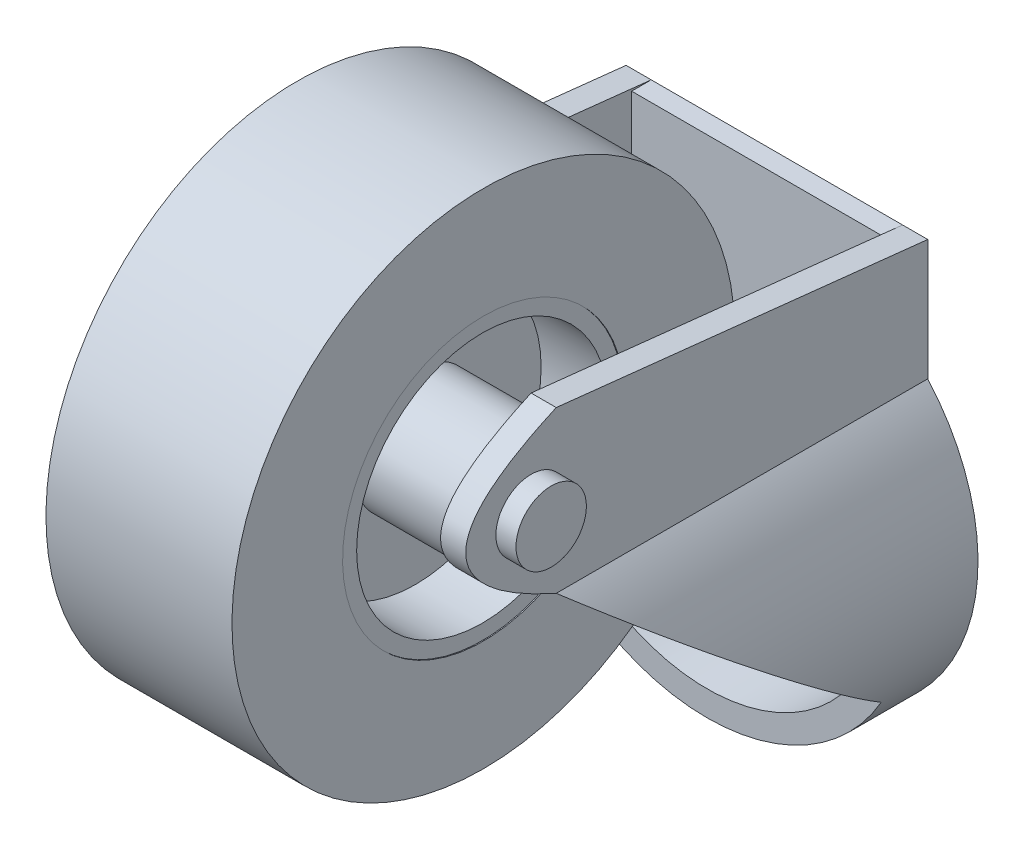
ISO-10303-21;
HEADER;
FILE_DESCRIPTION(('STEP AP214'),'2;1');
FILE_NAME('part.step','',(''),(''),'','','');
FILE_SCHEMA(('AUTOMOTIVE_DESIGN { 1 0 10303 214 1 1 1 1 }'));
ENDSEC;
DATA;
#1=APPLICATION_CONTEXT('core data for automotive mechanical design processes');
#2=APPLICATION_PROTOCOL_DEFINITION('international standard','automotive_design',2000,#1);
#3=PRODUCT_CONTEXT('',#1,'mechanical');
#4=PRODUCT('Part','Part','',(#3));
#5=PRODUCT_RELATED_PRODUCT_CATEGORY('part','',(#4));
#6=PRODUCT_DEFINITION_FORMATION('','',#4);
#7=PRODUCT_DEFINITION_CONTEXT('part definition',#1,'design');
#8=PRODUCT_DEFINITION('design','',#6,#7);
#9=PRODUCT_DEFINITION_SHAPE('','',#8);
#10=(LENGTH_UNIT() NAMED_UNIT(*) SI_UNIT(.MILLI.,.METRE.));
#11=(NAMED_UNIT(*) PLANE_ANGLE_UNIT() SI_UNIT($,.RADIAN.));
#12=(NAMED_UNIT(*) SI_UNIT($,.STERADIAN.) SOLID_ANGLE_UNIT());
#13=UNCERTAINTY_MEASURE_WITH_UNIT(LENGTH_MEASURE(1.E-05),#10,'distance_accuracy_value','');
#14=(GEOMETRIC_REPRESENTATION_CONTEXT(3) GLOBAL_UNCERTAINTY_ASSIGNED_CONTEXT((#13)) GLOBAL_UNIT_ASSIGNED_CONTEXT((#10,
#11,#12)) REPRESENTATION_CONTEXT('',''));
#15=CARTESIAN_POINT('',(0.,0.,0.));
#16=DIRECTION('',(0.,0.,1.));
#17=DIRECTION('',(1.,0.,0.));
#18=AXIS2_PLACEMENT_3D('',#15,#16,#17);
#19=CARTESIAN_POINT('',(-8.99996347011657,21.2287151304649,38.7000000000901));
#20=DIRECTION('',(1.,0.,0.));
#21=DIRECTION('',(0.,1.,0.));
#22=AXIS2_PLACEMENT_3D('',#19,#20,#21);
#23=CYLINDRICAL_SURFACE('',#22,12.5);
#24=CARTESIAN_POINT('',(2.75003652988343,21.2287151304649,38.7000000000901));
#25=DIRECTION('',(-1.,0.,0.));
#26=DIRECTION('',(0.,-1.,0.));
#27=AXIS2_PLACEMENT_3D('',#24,#25,#26);
#28=CIRCLE('',#27,12.5);
#29=CARTESIAN_POINT('',(2.75003652988342,8.72871513046489,38.7000000000901));
#30=VERTEX_POINT('',#29);
#31=EDGE_CURVE('E272',#30,#30,#28,.T.);
#32=ORIENTED_EDGE('',*,*,#31,.T.);
#33=EDGE_LOOP('',(#32));
#34=FACE_BOUND('',#33,.T.);
#35=CARTESIAN_POINT('',(9.40003652988343,21.2287151304649,38.7000000000901));
#36=DIRECTION('',(1.,0.,0.));
#37=DIRECTION('',(0.,1.,0.));
#38=AXIS2_PLACEMENT_3D('',#35,#36,#37);
#39=CIRCLE('',#38,12.5);
#40=CARTESIAN_POINT('',(9.40003652988343,33.7287151304649,38.7000000000901));
#41=VERTEX_POINT('',#40);
#42=EDGE_CURVE('E492',#41,#41,#39,.T.);
#43=ORIENTED_EDGE('',*,*,#42,.T.);
#44=EDGE_LOOP('',(#43));
#45=FACE_BOUND('',#44,.T.);
#46=ADVANCED_FACE('F50',(#34,#45),#23,.F.);
#47=CARTESIAN_POINT('',(-2.24996347011657,21.2287151304649,38.7000000000901));
#48=DIRECTION('',(-1.,0.,0.));
#49=DIRECTION('',(0.,-1.,0.));
#50=AXIS2_PLACEMENT_3D('',#47,#48,#49);
#51=CIRCLE('',#50,12.5);
#52=CARTESIAN_POINT('',(-2.24996347011658,8.7287151304649,38.7000000000901));
#53=VERTEX_POINT('',#52);
#54=EDGE_CURVE('E274',#53,#53,#51,.F.);
#55=ORIENTED_EDGE('',*,*,#54,.T.);
#56=EDGE_LOOP('',(#55));
#57=FACE_BOUND('',#56,.T.);
#58=CARTESIAN_POINT('',(-8.89996347011657,21.2287151304649,38.7000000000899));
#59=DIRECTION('',(-1.,0.,0.));
#60=DIRECTION('',(0.,-1.,0.));
#61=AXIS2_PLACEMENT_3D('',#58,#59,#60);
#62=CIRCLE('',#61,12.5000000000002);
#63=CARTESIAN_POINT('',(-8.89996347011658,8.72871513046471,38.7000000000899));
#64=VERTEX_POINT('',#63);
#65=EDGE_CURVE('E484',#64,#64,#62,.T.);
#66=ORIENTED_EDGE('',*,*,#65,.T.);
#67=EDGE_LOOP('',(#66));
#68=FACE_BOUND('',#67,.T.);
#69=ADVANCED_FACE('F239',(#57,#68),#23,.F.);
#70=CARTESIAN_POINT('',(-12.5000365298834,25.2287151342132,6.95));
#71=DIRECTION('',(-1.,0.,0.));
#72=DIRECTION('',(0.,-1.,0.));
#73=AXIS2_PLACEMENT_3D('',#70,#71,#72);
#74=PLANE('',#73);
#75=DIRECTION('',(0.,0.612221207535144,0.79068653273229));
#76=VECTOR('',#75,1.);
#77=CARTESIAN_POINT('',(-12.5000365298834,3.20424090214857,24.0033449748874));
#78=LINE('',#77,#76);
#79=CARTESIAN_POINT('',(-12.5000365298834,12.2474114306485,35.682641709599));
#80=VERTEX_POINT('',#79);
#81=CARTESIAN_POINT('',(-12.5000365298834,13.2287151342133,36.95));
#82=VERTEX_POINT('',#81);
#83=EDGE_CURVE('E287',#80,#82,#78,.T.);
#84=ORIENTED_EDGE('',*,*,#83,.F.);
#85=DIRECTION('',(0.,0.,-1.));
#86=VECTOR('',#85,1.);
#87=CARTESIAN_POINT('',(-12.5000365298834,12.2474114306485,6.95));
#88=LINE('',#87,#86);
#89=CARTESIAN_POINT('',(-12.5000365298834,12.2474114306485,1.95));
#90=VERTEX_POINT('',#89);
#91=EDGE_CURVE('E73',#80,#90,#88,.T.);
#92=ORIENTED_EDGE('',*,*,#91,.T.);
#93=DIRECTION('',(0.,1.,0.));
#94=VECTOR('',#93,1.);
#95=CARTESIAN_POINT('',(-12.5000365298834,25.2287151342132,1.95));
#96=LINE('',#95,#94);
#97=CARTESIAN_POINT('',(-12.5000365298834,25.2287151342132,1.95));
#98=VERTEX_POINT('',#97);
#99=EDGE_CURVE('E170',#90,#98,#96,.T.);
#100=ORIENTED_EDGE('',*,*,#99,.T.);
#101=DIRECTION('',(0.,0.,1.));
#102=VECTOR('',#101,1.);
#103=CARTESIAN_POINT('',(-12.5000365298834,25.2287151342132,0.));
#104=LINE('',#103,#102);
#105=CARTESIAN_POINT('',(-12.5000365298834,25.2287151342132,0.));
#106=VERTEX_POINT('',#105);
#107=EDGE_CURVE('E355',#106,#98,#104,.T.);
#108=ORIENTED_EDGE('',*,*,#107,.F.);
#109=DIRECTION('',(0.,-0.107625601573369,-0.994191495581193));
#110=VECTOR('',#109,1.);
#111=CARTESIAN_POINT('',(-12.5000365298834,29.22871513,36.95));
#112=LINE('',#111,#110);
#113=CARTESIAN_POINT('',(-12.5000365298834,29.22871513,36.95));
#114=VERTEX_POINT('',#113);
#115=EDGE_CURVE('E367',#114,#106,#112,.T.);
#116=ORIENTED_EDGE('',*,*,#115,.F.);
#117=CARTESIAN_POINT('',(-12.5000365298834,13.2287151342133,36.95));
#118=CARTESIAN_POINT('',(-12.5000365298834,21.228715129753,54.95));
#119=CARTESIAN_POINT('',(-12.5000365298834,29.22871513,36.95));
#120=B_SPLINE_CURVE_WITH_KNOTS('',2,(#117,#118,#119),.UNSPECIFIED.,.F.,.F.,(3,3),(0.,1.),.UNSPECIFIED.);
#121=EDGE_CURVE('E401',#114,#82,#120,.F.);
#122=ORIENTED_EDGE('',*,*,#121,.T.);
#123=EDGE_LOOP('',(#84,#92,#100,#108,#116,#122));
#124=FACE_BOUND('',#123,.T.);
#125=CARTESIAN_POINT('',(-12.5000365299002,21.2287151304525,38.7000000000048));
#126=DIRECTION('',(-1.,0.,0.));
#127=DIRECTION('',(0.,-1.,0.));
#128=AXIS2_PLACEMENT_3D('',#125,#126,#127);
#129=CIRCLE('',#128,5.99999999999999);
#130=CARTESIAN_POINT('',(-12.5000365299002,15.2287151304525,38.7000000000048));
#131=VERTEX_POINT('',#130);
#132=EDGE_CURVE('E12',#131,#131,#129,.F.);
#133=ORIENTED_EDGE('',*,*,#132,.F.);
#134=EDGE_LOOP('',(#133));
#135=FACE_BOUND('',#134,.T.);
#136=ADVANCED_FACE('F233',(#124,#135),#74,.F.);
#137=CARTESIAN_POINT('',(-2.24996347011657,21.2287151304649,38.7000000000901));
#138=DIRECTION('',(-1.,0.,0.));
#139=DIRECTION('',(0.,-1.,0.));
#140=AXIS2_PLACEMENT_3D('',#137,#138,#139);
#141=PLANE('',#140);
#142=ORIENTED_EDGE('',*,*,#54,.F.);
#143=EDGE_LOOP('',(#142));
#144=FACE_BOUND('',#143,.T.);
#145=CARTESIAN_POINT('',(-2.2499634700921,21.2287151304525,38.7000000000048));
#146=DIRECTION('',(-1.,0.,0.));
#147=DIRECTION('',(0.,-1.,0.));
#148=AXIS2_PLACEMENT_3D('',#145,#146,#147);
#149=CIRCLE('',#148,5.99999999999999);
#150=CARTESIAN_POINT('',(-2.2499634700921,15.2287151304525,38.7000000000048));
#151=VERTEX_POINT('',#150);
#152=EDGE_CURVE('E466',#151,#151,#149,.T.);
#153=ORIENTED_EDGE('',*,*,#152,.F.);
#154=EDGE_LOOP('',(#153));
#155=FACE_BOUND('',#154,.T.);
#156=ADVANCED_FACE('F223',(#144,#155),#141,.T.);
#157=CARTESIAN_POINT('',(0.250036529883426,21.2287151304649,38.7000000000901));
#158=DIRECTION('',(1.,0.,0.));
#159=DIRECTION('',(0.,1.,0.));
#160=AXIS2_PLACEMENT_3D('',#157,#158,#159);
#161=CYLINDRICAL_SURFACE('',#160,6.);
#162=CARTESIAN_POINT('',(12.5000365298834,21.2287151304649,38.7000000000901));
#163=DIRECTION('',(1.,0.,0.));
#164=DIRECTION('',(0.,1.,0.));
#165=AXIS2_PLACEMENT_3D('',#162,#163,#164);
#166=CIRCLE('',#165,6.);
#167=CARTESIAN_POINT('',(12.5000365298834,27.2287151304649,38.7000000000901));
#168=VERTEX_POINT('',#167);
#169=EDGE_CURVE('E213',#168,#168,#166,.F.);
#170=ORIENTED_EDGE('',*,*,#169,.T.);
#171=EDGE_LOOP('',(#170));
#172=FACE_BOUND('',#171,.T.);
#173=CARTESIAN_POINT('',(2.75003652988343,21.2287151304649,38.7000000000901));
#174=DIRECTION('',(-1.,0.,0.));
#175=DIRECTION('',(0.,-1.,0.));
#176=AXIS2_PLACEMENT_3D('',#173,#174,#175);
#177=CIRCLE('',#176,6.);
#178=CARTESIAN_POINT('',(2.75003652988342,15.2287151304649,38.7000000000901));
#179=VERTEX_POINT('',#178);
#180=EDGE_CURVE('E58',#179,#179,#177,.T.);
#181=ORIENTED_EDGE('',*,*,#180,.F.);
#182=EDGE_LOOP('',(#181));
#183=FACE_BOUND('',#182,.T.);
#184=ADVANCED_FACE('F220',(#172,#183),#161,.T.);
#185=CARTESIAN_POINT('',(12.5000365298834,25.2287151342132,6.95));
#186=DIRECTION('',(1.,0.,0.));
#187=DIRECTION('',(0.,1.,0.));
#188=AXIS2_PLACEMENT_3D('',#185,#186,#187);
#189=PLANE('',#188);
#190=DIRECTION('',(0.,-0.612221207535144,-0.79068653273229));
#191=VECTOR('',#190,1.);
#192=CARTESIAN_POINT('',(12.5000365298834,3.20424090214857,24.0033449748874));
#193=LINE('',#192,#191);
#194=CARTESIAN_POINT('',(12.5000365298834,13.2287151342133,36.95));
#195=VERTEX_POINT('',#194);
#196=CARTESIAN_POINT('',(12.5000365298834,12.2474114306485,35.682641709599));
#197=VERTEX_POINT('',#196);
#198=EDGE_CURVE('E295',#195,#197,#193,.T.);
#199=ORIENTED_EDGE('',*,*,#198,.F.);
#200=CARTESIAN_POINT('',(12.5000365298834,13.2287151342133,36.95));
#201=CARTESIAN_POINT('',(12.5000365298834,21.228715129753,54.95));
#202=CARTESIAN_POINT('',(12.5000365298834,29.22871513,36.95));
#203=B_SPLINE_CURVE_WITH_KNOTS('',2,(#200,#201,#202),.UNSPECIFIED.,.F.,.F.,(3,3),(0.,1.),.UNSPECIFIED.);
#204=CARTESIAN_POINT('',(12.5000365298834,29.22871513,36.95));
#205=VERTEX_POINT('',#204);
#206=EDGE_CURVE('E376',#195,#205,#203,.T.);
#207=ORIENTED_EDGE('',*,*,#206,.T.);
#208=DIRECTION('',(0.,0.107625601573369,0.994191495581193));
#209=VECTOR('',#208,1.);
#210=CARTESIAN_POINT('',(12.5000365298834,29.22871513,36.95));
#211=LINE('',#210,#209);
#212=CARTESIAN_POINT('',(12.5000365298834,25.2287151342132,0.));
#213=VERTEX_POINT('',#212);
#214=EDGE_CURVE('E416',#213,#205,#211,.T.);
#215=ORIENTED_EDGE('',*,*,#214,.F.);
#216=DIRECTION('',(0.,0.,-1.));
#217=VECTOR('',#216,1.);
#218=CARTESIAN_POINT('',(12.5000365298834,25.2287151342132,0.));
#219=LINE('',#218,#217);
#220=CARTESIAN_POINT('',(12.5000365298834,25.2287151342132,1.95));
#221=VERTEX_POINT('',#220);
#222=EDGE_CURVE('E190',#221,#213,#219,.T.);
#223=ORIENTED_EDGE('',*,*,#222,.F.);
#224=DIRECTION('',(0.,-1.,0.));
#225=VECTOR('',#224,1.);
#226=CARTESIAN_POINT('',(12.5000365298834,25.2287151342132,1.95));
#227=LINE('',#226,#225);
#228=CARTESIAN_POINT('',(12.5000365298834,12.2474114306485,1.95));
#229=VERTEX_POINT('',#228);
#230=EDGE_CURVE('E429',#221,#229,#227,.T.);
#231=ORIENTED_EDGE('',*,*,#230,.T.);
#232=DIRECTION('',(0.,0.,-1.));
#233=VECTOR('',#232,1.);
#234=CARTESIAN_POINT('',(12.5000365298834,12.2474114306485,6.95));
#235=LINE('',#234,#233);
#236=EDGE_CURVE('E436',#197,#229,#235,.T.);
#237=ORIENTED_EDGE('',*,*,#236,.F.);
#238=EDGE_LOOP('',(#199,#207,#215,#223,#231,#237));
#239=FACE_BOUND('',#238,.T.);
#240=ORIENTED_EDGE('',*,*,#169,.F.);
#241=EDGE_LOOP('',(#240));
#242=FACE_BOUND('',#241,.T.);
#243=ADVANCED_FACE('F222',(#239,#242),#189,.F.);
#244=CARTESIAN_POINT('',(15.0000365298834,13.2287151342133,1.95));
#245=DIRECTION('',(-1.,0.,0.));
#246=DIRECTION('',(0.,0.,1.));
#247=AXIS2_PLACEMENT_3D('',#244,#245,#246);
#248=PLANE('',#247);
#249=DIRECTION('',(0.,0.107625601573369,0.994191495581193));
#250=VECTOR('',#249,1.);
#251=CARTESIAN_POINT('',(15.0000365298834,29.22871513,36.95));
#252=LINE('',#251,#250);
#253=CARTESIAN_POINT('',(15.0000365298834,25.2287151342132,0.));
#254=VERTEX_POINT('',#253);
#255=CARTESIAN_POINT('',(15.0000365298834,29.22871513,36.95));
#256=VERTEX_POINT('',#255);
#257=EDGE_CURVE('E382',#254,#256,#252,.T.);
#258=ORIENTED_EDGE('',*,*,#257,.T.);
#259=CARTESIAN_POINT('',(15.0000365298834,13.2287151342133,36.95));
#260=CARTESIAN_POINT('',(15.0000365298834,21.228715129753,54.95));
#261=CARTESIAN_POINT('',(15.0000365298834,29.22871513,36.95));
#262=B_SPLINE_CURVE_WITH_KNOTS('',2,(#259,#260,#261),.UNSPECIFIED.,.F.,.F.,(3,3),(0.,1.),.UNSPECIFIED.);
#263=CARTESIAN_POINT('',(15.0000365298834,13.2287151342133,36.95));
#264=VERTEX_POINT('',#263);
#265=EDGE_CURVE('E164',#264,#256,#262,.T.);
#266=ORIENTED_EDGE('',*,*,#265,.F.);
#267=DIRECTION('',(0.,0.,-1.));
#268=VECTOR('',#267,1.);
#269=CARTESIAN_POINT('',(15.0000365298834,13.2287151342133,1.95));
#270=LINE('',#269,#268);
#271=CARTESIAN_POINT('',(15.0000365298834,13.2287151342133,0.));
#272=VERTEX_POINT('',#271);
#273=EDGE_CURVE('E163',#264,#272,#270,.T.);
#274=ORIENTED_EDGE('',*,*,#273,.T.);
#275=DIRECTION('',(0.,1.,0.));
#276=VECTOR('',#275,1.);
#277=CARTESIAN_POINT('',(15.0000365298834,13.2287151342133,0.));
#278=LINE('',#277,#276);
#279=EDGE_CURVE('E189',#272,#254,#278,.T.);
#280=ORIENTED_EDGE('',*,*,#279,.T.);
#281=EDGE_LOOP('',(#258,#266,#274,#280));
#282=FACE_BOUND('',#281,.T.);
#283=CARTESIAN_POINT('',(15.0000365298834,21.2287151304657,39.4500000000901));
#284=DIRECTION('',(-1.,0.,0.));
#285=DIRECTION('',(0.,0.,1.));
#286=AXIS2_PLACEMENT_3D('',#283,#284,#285);
#287=CIRCLE('',#286,3.5);
#288=CARTESIAN_POINT('',(15.0000365298834,21.2287151304657,42.9500000000901));
#289=VERTEX_POINT('',#288);
#290=EDGE_CURVE('E210',#289,#289,#287,.F.);
#291=ORIENTED_EDGE('',*,*,#290,.F.);
#292=EDGE_LOOP('',(#291));
#293=FACE_BOUND('',#292,.T.);
#294=ADVANCED_FACE('F230',(#282,#293),#248,.F.);
#295=CARTESIAN_POINT('',(-15.0000365298834,13.2287151342133,1.95));
#296=DIRECTION('',(-1.,0.,0.));
#297=DIRECTION('',(0.,0.,1.));
#298=AXIS2_PLACEMENT_3D('',#295,#296,#297);
#299=PLANE('',#298);
#300=CARTESIAN_POINT('',(-15.0000365298834,13.2287151342133,36.95));
#301=CARTESIAN_POINT('',(-15.0000365298834,21.228715129753,54.95));
#302=CARTESIAN_POINT('',(-15.0000365298834,29.22871513,36.95));
#303=B_SPLINE_CURVE_WITH_KNOTS('',2,(#300,#301,#302),.UNSPECIFIED.,.F.,.F.,(3,3),(0.,1.),.UNSPECIFIED.);
#304=CARTESIAN_POINT('',(-15.0000365298834,29.22871513,36.95));
#305=VERTEX_POINT('',#304);
#306=CARTESIAN_POINT('',(-15.0000365298834,13.2287151342133,36.95));
#307=VERTEX_POINT('',#306);
#308=EDGE_CURVE('E373',#305,#307,#303,.F.);
#309=ORIENTED_EDGE('',*,*,#308,.F.);
#310=DIRECTION('',(0.,-0.107625601573369,-0.994191495581193));
#311=VECTOR('',#310,1.);
#312=CARTESIAN_POINT('',(-15.0000365298834,29.22871513,36.95));
#313=LINE('',#312,#311);
#314=CARTESIAN_POINT('',(-15.0000365298834,25.2287151342132,0.));
#315=VERTEX_POINT('',#314);
#316=EDGE_CURVE('E365',#305,#315,#313,.T.);
#317=ORIENTED_EDGE('',*,*,#316,.T.);
#318=DIRECTION('',(0.,1.,0.));
#319=VECTOR('',#318,1.);
#320=CARTESIAN_POINT('',(-15.0000365298834,13.2287151342133,0.));
#321=LINE('',#320,#319);
#322=CARTESIAN_POINT('',(-15.0000365298834,13.2287151342133,0.));
#323=VERTEX_POINT('',#322);
#324=EDGE_CURVE('E196',#323,#315,#321,.T.);
#325=ORIENTED_EDGE('',*,*,#324,.F.);
#326=DIRECTION('',(0.,0.,-1.));
#327=VECTOR('',#326,1.);
#328=CARTESIAN_POINT('',(-15.0000365298834,13.2287151342133,1.95));
#329=LINE('',#328,#327);
#330=EDGE_CURVE('E426',#307,#323,#329,.T.);
#331=ORIENTED_EDGE('',*,*,#330,.F.);
#332=EDGE_LOOP('',(#309,#317,#325,#331));
#333=FACE_BOUND('',#332,.T.);
#334=CARTESIAN_POINT('',(-15.0000365298834,21.228715130455,39.4500000000048));
#335=DIRECTION('',(-1.,0.,0.));
#336=DIRECTION('',(0.,0.,1.));
#337=AXIS2_PLACEMENT_3D('',#334,#335,#336);
#338=CIRCLE('',#337,3.5);
#339=CARTESIAN_POINT('',(-15.0000365298834,21.228715130455,42.9500000000048));
#340=VERTEX_POINT('',#339);
#341=EDGE_CURVE('E277',#340,#340,#338,.T.);
#342=ORIENTED_EDGE('',*,*,#341,.F.);
#343=EDGE_LOOP('',(#342));
#344=FACE_BOUND('',#343,.T.);
#345=ADVANCED_FACE('F52',(#333,#344),#299,.T.);
#346=CARTESIAN_POINT('',(0.,0.,1.95));
#347=DIRECTION('',(0.,0.,-1.));
#348=DIRECTION('',(-1.,0.,0.));
#349=AXIS2_PLACEMENT_3D('',#346,#347,#348);
#350=CYLINDRICAL_SURFACE('',#349,20.);
#351=CARTESIAN_POINT('',(0.,0.,19.8650529690303));
#352=DIRECTION('',(0.,-0.79068653273229,0.612221207535144));
#353=DIRECTION('',(0.,-0.612221207535144,-0.79068653273229));
#354=AXIS2_PLACEMENT_3D('',#351,#352,#353);
#355=ELLIPSE('',#354,32.6679307313148,20.);
#356=CARTESIAN_POINT('',(17.3205051573014,-10.0000050547935,6.95));
#357=VERTEX_POINT('',#356);
#358=EDGE_CURVE('E145',#357,#264,#355,.T.);
#359=ORIENTED_EDGE('',*,*,#358,.F.);
#360=CARTESIAN_POINT('',(0.,0.,6.95));
#361=DIRECTION('',(0.,0.,1.));
#362=DIRECTION('',(1.,0.,0.));
#363=AXIS2_PLACEMENT_3D('',#360,#361,#362);
#364=CIRCLE('',#363,20.);
#365=CARTESIAN_POINT('',(-17.3205051573014,-10.0000050547935,6.95));
#366=VERTEX_POINT('',#365);
#367=EDGE_CURVE('E161',#366,#357,#364,.T.);
#368=ORIENTED_EDGE('',*,*,#367,.F.);
#369=EDGE_CURVE('E165',#307,#366,#355,.T.);
#370=ORIENTED_EDGE('',*,*,#369,.F.);
#371=ORIENTED_EDGE('',*,*,#330,.T.);
#372=CARTESIAN_POINT('',(0.,0.,0.));
#373=DIRECTION('',(0.,0.,1.));
#374=DIRECTION('',(1.,0.,0.));
#375=AXIS2_PLACEMENT_3D('',#372,#373,#374);
#376=CIRCLE('',#375,20.);
#377=EDGE_CURVE('E422',#323,#272,#376,.T.);
#378=ORIENTED_EDGE('',*,*,#377,.T.);
#379=ORIENTED_EDGE('',*,*,#273,.F.);
#380=EDGE_LOOP('',(#359,#368,#370,#371,#378,#379));
#381=FACE_BOUND('',#380,.T.);
#382=ADVANCED_FACE('F159',(#381),#350,.T.);
#383=CARTESIAN_POINT('',(0.,0.,6.95));
#384=DIRECTION('',(0.,0.,-1.));
#385=DIRECTION('',(-1.,0.,0.));
#386=AXIS2_PLACEMENT_3D('',#383,#384,#385);
#387=CYLINDRICAL_SURFACE('',#386,17.5);
#388=CARTESIAN_POINT('',(0.,0.,19.8650529690303));
#389=DIRECTION('',(0.,-0.79068653273229,0.612221207535144));
#390=DIRECTION('',(0.,-0.612221207535144,-0.79068653273229));
#391=AXIS2_PLACEMENT_3D('',#388,#389,#390);
#392=ELLIPSE('',#391,28.5844393899005,17.5);
#393=CARTESIAN_POINT('',(-14.3614030966373,-10.0000050547935,6.95));
#394=VERTEX_POINT('',#393);
#395=EDGE_CURVE('E291',#394,#80,#392,.F.);
#396=ORIENTED_EDGE('',*,*,#395,.F.);
#397=CARTESIAN_POINT('',(0.,0.,6.95));
#398=DIRECTION('',(0.,0.,-1.));
#399=DIRECTION('',(1.,0.,0.));
#400=AXIS2_PLACEMENT_3D('',#397,#398,#399);
#401=CIRCLE('',#400,17.5);
#402=CARTESIAN_POINT('',(14.3614030966373,-10.0000050547935,6.95));
#403=VERTEX_POINT('',#402);
#404=EDGE_CURVE('E169',#403,#394,#401,.T.);
#405=ORIENTED_EDGE('',*,*,#404,.F.);
#406=EDGE_CURVE('E148',#197,#403,#392,.F.);
#407=ORIENTED_EDGE('',*,*,#406,.F.);
#408=ORIENTED_EDGE('',*,*,#236,.T.);
#409=CARTESIAN_POINT('',(0.,0.,1.95));
#410=DIRECTION('',(0.,0.,-1.));
#411=DIRECTION('',(1.,0.,0.));
#412=AXIS2_PLACEMENT_3D('',#409,#410,#411);
#413=CIRCLE('',#412,17.5);
#414=EDGE_CURVE('E173',#229,#90,#413,.T.);
#415=ORIENTED_EDGE('',*,*,#414,.T.);
#416=ORIENTED_EDGE('',*,*,#91,.F.);
#417=EDGE_LOOP('',(#396,#405,#407,#408,#415,#416));
#418=FACE_BOUND('',#417,.T.);
#419=ADVANCED_FACE('F332',(#418),#387,.F.);
#420=CARTESIAN_POINT('',(-15.0000365298834,25.2287151342132,1.95));
#421=DIRECTION('',(0.,1.,0.));
#422=DIRECTION('',(0.,0.,1.));
#423=AXIS2_PLACEMENT_3D('',#420,#421,#422);
#424=PLANE('',#423);
#425=DIRECTION('',(1.,0.,0.));
#426=VECTOR('',#425,1.);
#427=CARTESIAN_POINT('',(-15.0000365298834,25.2287151342132,0.));
#428=LINE('',#427,#426);
#429=EDGE_CURVE('E65',#106,#213,#428,.T.);
#430=ORIENTED_EDGE('',*,*,#429,.F.);
#431=ORIENTED_EDGE('',*,*,#107,.T.);
#432=DIRECTION('',(1.,0.,0.));
#433=VECTOR('',#432,1.);
#434=CARTESIAN_POINT('',(-15.0000365298834,25.2287151342132,1.95));
#435=LINE('',#434,#433);
#436=EDGE_CURVE('E423',#98,#221,#435,.T.);
#437=ORIENTED_EDGE('',*,*,#436,.T.);
#438=ORIENTED_EDGE('',*,*,#222,.T.);
#439=EDGE_LOOP('',(#430,#431,#437,#438));
#440=FACE_BOUND('',#439,.T.);
#441=ADVANCED_FACE('F329',(#440),#424,.T.);
#442=CARTESIAN_POINT('',(0.,0.,6.95));
#443=DIRECTION('',(0.,0.,1.));
#444=DIRECTION('',(1.,0.,0.));
#445=AXIS2_PLACEMENT_3D('',#442,#443,#444);
#446=PLANE('',#445);
#447=ORIENTED_EDGE('',*,*,#367,.T.);
#448=DIRECTION('',(1.,0.,0.));
#449=VECTOR('',#448,1.);
#450=CARTESIAN_POINT('',(17.3205051573014,-10.0000050547935,6.95));
#451=LINE('',#450,#449);
#452=EDGE_CURVE('E142',#403,#357,#451,.T.);
#453=ORIENTED_EDGE('',*,*,#452,.F.);
#454=ORIENTED_EDGE('',*,*,#404,.T.);
#455=DIRECTION('',(1.,0.,0.));
#456=VECTOR('',#455,1.);
#457=CARTESIAN_POINT('',(-17.3205051573014,-10.0000050547935,6.95));
#458=LINE('',#457,#456);
#459=EDGE_CURVE('E153',#366,#394,#458,.T.);
#460=ORIENTED_EDGE('',*,*,#459,.F.);
#461=EDGE_LOOP('',(#447,#453,#454,#460));
#462=FACE_BOUND('',#461,.T.);
#463=ADVANCED_FACE('F168',(#462),#446,.T.);
#464=CARTESIAN_POINT('',(0.,0.,1.95));
#465=DIRECTION('',(0.,0.,1.));
#466=DIRECTION('',(1.,0.,0.));
#467=AXIS2_PLACEMENT_3D('',#464,#465,#466);
#468=PLANE('',#467);
#469=ORIENTED_EDGE('',*,*,#99,.F.);
#470=ORIENTED_EDGE('',*,*,#414,.F.);
#471=ORIENTED_EDGE('',*,*,#230,.F.);
#472=ORIENTED_EDGE('',*,*,#436,.F.);
#473=EDGE_LOOP('',(#469,#470,#471,#472));
#474=FACE_BOUND('',#473,.T.);
#475=CARTESIAN_POINT('',(0.,0.,1.95));
#476=DIRECTION('',(0.,0.,1.));
#477=DIRECTION('',(1.,0.,0.));
#478=AXIS2_PLACEMENT_3D('',#475,#476,#477);
#479=CIRCLE('',#478,7.5);
#480=CARTESIAN_POINT('',(7.5,0.,1.95));
#481=VERTEX_POINT('',#480);
#482=EDGE_CURVE('E435',#481,#481,#479,.T.);
#483=ORIENTED_EDGE('',*,*,#482,.F.);
#484=EDGE_LOOP('',(#483));
#485=FACE_BOUND('',#484,.T.);
#486=ADVANCED_FACE('F328',(#474,#485),#468,.T.);
#487=CARTESIAN_POINT('',(0.,0.,0.));
#488=DIRECTION('',(0.,0.,1.));
#489=DIRECTION('',(1.,0.,0.));
#490=AXIS2_PLACEMENT_3D('',#487,#488,#489);
#491=PLANE('',#490);
#492=ORIENTED_EDGE('',*,*,#324,.T.);
#493=EDGE_CURVE('E186',#315,#106,#428,.T.);
#494=ORIENTED_EDGE('',*,*,#493,.T.);
#495=ORIENTED_EDGE('',*,*,#429,.T.);
#496=DIRECTION('',(1.,0.,0.));
#497=VECTOR('',#496,1.);
#498=CARTESIAN_POINT('',(12.5000365298834,25.2287151342132,0.));
#499=LINE('',#498,#497);
#500=EDGE_CURVE('E207',#213,#254,#499,.T.);
#501=ORIENTED_EDGE('',*,*,#500,.T.);
#502=ORIENTED_EDGE('',*,*,#279,.F.);
#503=ORIENTED_EDGE('',*,*,#377,.F.);
#504=EDGE_LOOP('',(#492,#494,#495,#501,#502,#503));
#505=FACE_BOUND('',#504,.T.);
#506=CARTESIAN_POINT('',(0.,0.,0.));
#507=DIRECTION('',(0.,0.,1.));
#508=DIRECTION('',(1.,0.,0.));
#509=AXIS2_PLACEMENT_3D('',#506,#507,#508);
#510=CIRCLE('',#509,7.5);
#511=CARTESIAN_POINT('',(7.5,0.,0.));
#512=VERTEX_POINT('',#511);
#513=EDGE_CURVE('E432',#512,#512,#510,.T.);
#514=ORIENTED_EDGE('',*,*,#513,.T.);
#515=EDGE_LOOP('',(#514));
#516=FACE_BOUND('',#515,.T.);
#517=ADVANCED_FACE('F338',(#505,#516),#491,.F.);
#518=CARTESIAN_POINT('',(0.,0.,1.95));
#519=DIRECTION('',(0.,0.,-1.));
#520=DIRECTION('',(-1.,0.,0.));
#521=AXIS2_PLACEMENT_3D('',#518,#519,#520);
#522=CYLINDRICAL_SURFACE('',#521,7.5);
#523=ORIENTED_EDGE('',*,*,#482,.T.);
#524=EDGE_LOOP('',(#523));
#525=FACE_BOUND('',#524,.T.);
#526=ORIENTED_EDGE('',*,*,#513,.F.);
#527=EDGE_LOOP('',(#526));
#528=FACE_BOUND('',#527,.T.);
#529=ADVANCED_FACE('F324',(#525,#528),#522,.F.);
#530=CARTESIAN_POINT('',(12.5000365298834,29.22871513,36.95));
#531=DIRECTION('',(0.,0.994191495581194,-0.107625601573369));
#532=DIRECTION('',(0.,0.107625601573369,0.994191495581194));
#533=AXIS2_PLACEMENT_3D('',#530,#531,#532);
#534=PLANE('',#533);
#535=ORIENTED_EDGE('',*,*,#257,.F.);
#536=ORIENTED_EDGE('',*,*,#500,.F.);
#537=ORIENTED_EDGE('',*,*,#214,.T.);
#538=DIRECTION('',(1.,0.,0.));
#539=VECTOR('',#538,1.);
#540=CARTESIAN_POINT('',(12.5000365298834,29.22871513,36.95));
#541=LINE('',#540,#539);
#542=EDGE_CURVE('E154',#205,#256,#541,.T.);
#543=ORIENTED_EDGE('',*,*,#542,.T.);
#544=EDGE_LOOP('',(#535,#536,#537,#543));
#545=FACE_BOUND('',#544,.T.);
#546=ADVANCED_FACE('F320',(#545),#534,.T.);
#547=CARTESIAN_POINT('',(-12.5000365298834,29.22871513,36.95));
#548=DIRECTION('',(0.,0.994191495581194,-0.107625601573369));
#549=DIRECTION('',(0.,0.107625601573369,0.994191495581194));
#550=AXIS2_PLACEMENT_3D('',#547,#548,#549);
#551=PLANE('',#550);
#552=ORIENTED_EDGE('',*,*,#316,.F.);
#553=DIRECTION('',(-1.,0.,0.));
#554=VECTOR('',#553,1.);
#555=CARTESIAN_POINT('',(-12.5000365298834,29.22871513,36.95));
#556=LINE('',#555,#554);
#557=EDGE_CURVE('E381',#114,#305,#556,.T.);
#558=ORIENTED_EDGE('',*,*,#557,.F.);
#559=ORIENTED_EDGE('',*,*,#115,.T.);
#560=ORIENTED_EDGE('',*,*,#493,.F.);
#561=EDGE_LOOP('',(#552,#558,#559,#560));
#562=FACE_BOUND('',#561,.T.);
#563=ADVANCED_FACE('F317',(#562),#551,.T.);
#564=CARTESIAN_POINT('',(-27.4999634701166,13.2287151342133,36.95));
#565=CARTESIAN_POINT('',(-27.4999634701166,21.228715129753,54.95));
#566=CARTESIAN_POINT('',(-27.4999634701166,29.22871513,36.95));
#567=B_SPLINE_CURVE_WITH_KNOTS('',2,(#564,#565,#566),.UNSPECIFIED.,.F.,.F.,(3,3),(0.,1.),.UNSPECIFIED.);
#568=DIRECTION('',(1.,0.,0.));
#569=VECTOR('',#568,1.);
#570=SURFACE_OF_LINEAR_EXTRUSION('',#567,#569);
#571=ORIENTED_EDGE('',*,*,#308,.T.);
#572=DIRECTION('',(1.,0.,0.));
#573=VECTOR('',#572,1.);
#574=CARTESIAN_POINT('',(-27.4999634701166,13.2287151342133,36.95));
#575=LINE('',#574,#573);
#576=EDGE_CURVE('E405',#307,#82,#575,.T.);
#577=ORIENTED_EDGE('',*,*,#576,.T.);
#578=ORIENTED_EDGE('',*,*,#121,.F.);
#579=ORIENTED_EDGE('',*,*,#557,.T.);
#580=EDGE_LOOP('',(#571,#577,#578,#579));
#581=FACE_BOUND('',#580,.T.);
#582=ADVANCED_FACE('F314',(#581),#570,.F.);
#583=EDGE_CURVE('E406',#195,#264,#575,.T.);
#584=ORIENTED_EDGE('',*,*,#583,.T.);
#585=ORIENTED_EDGE('',*,*,#265,.T.);
#586=ORIENTED_EDGE('',*,*,#542,.F.);
#587=ORIENTED_EDGE('',*,*,#206,.F.);
#588=EDGE_LOOP('',(#584,#585,#586,#587));
#589=FACE_BOUND('',#588,.T.);
#590=ADVANCED_FACE('F310',(#589),#570,.F.);
#591=CARTESIAN_POINT('',(57.5000365298834,13.2287151342133,36.95));
#592=DIRECTION('',(0.,-0.79068653273229,0.612221207535144));
#593=DIRECTION('',(0.,-0.612221207535144,-0.79068653273229));
#594=AXIS2_PLACEMENT_3D('',#591,#592,#593);
#595=PLANE('',#594);
#596=ORIENTED_EDGE('',*,*,#358,.T.);
#597=ORIENTED_EDGE('',*,*,#583,.F.);
#598=ORIENTED_EDGE('',*,*,#198,.T.);
#599=ORIENTED_EDGE('',*,*,#406,.T.);
#600=ORIENTED_EDGE('',*,*,#452,.T.);
#601=EDGE_LOOP('',(#596,#597,#598,#599,#600));
#602=FACE_BOUND('',#601,.T.);
#603=ADVANCED_FACE('F144',(#602),#595,.T.);
#604=ORIENTED_EDGE('',*,*,#369,.T.);
#605=ORIENTED_EDGE('',*,*,#459,.T.);
#606=ORIENTED_EDGE('',*,*,#395,.T.);
#607=ORIENTED_EDGE('',*,*,#83,.T.);
#608=ORIENTED_EDGE('',*,*,#576,.F.);
#609=EDGE_LOOP('',(#604,#605,#606,#607,#608));
#610=FACE_BOUND('',#609,.T.);
#611=ADVANCED_FACE('F451',(#610),#595,.T.);
#612=CARTESIAN_POINT('',(-17.0000365298834,21.228715130455,39.4500000000048));
#613=DIRECTION('',(1.,0.,0.));
#614=DIRECTION('',(0.,0.,-1.));
#615=AXIS2_PLACEMENT_3D('',#612,#613,#614);
#616=CYLINDRICAL_SURFACE('',#615,3.5);
#617=CARTESIAN_POINT('',(-17.0000365298834,21.228715130455,39.4500000000048));
#618=DIRECTION('',(-1.,0.,0.));
#619=DIRECTION('',(0.,0.,1.));
#620=AXIS2_PLACEMENT_3D('',#617,#618,#619);
#621=CIRCLE('',#620,3.5);
#622=CARTESIAN_POINT('',(-17.0000365298834,21.228715130455,42.9500000000048));
#623=VERTEX_POINT('',#622);
#624=EDGE_CURVE('E284',#623,#623,#621,.T.);
#625=ORIENTED_EDGE('',*,*,#624,.F.);
#626=EDGE_LOOP('',(#625));
#627=FACE_BOUND('',#626,.T.);
#628=ORIENTED_EDGE('',*,*,#341,.T.);
#629=EDGE_LOOP('',(#628));
#630=FACE_BOUND('',#629,.T.);
#631=ADVANCED_FACE('F607',(#627,#630),#616,.T.);
#632=CARTESIAN_POINT('',(-17.0000365298834,21.228715130455,39.4500000000048));
#633=DIRECTION('',(-1.,0.,0.));
#634=DIRECTION('',(0.,0.,1.));
#635=AXIS2_PLACEMENT_3D('',#632,#633,#634);
#636=PLANE('',#635);
#637=ORIENTED_EDGE('',*,*,#624,.T.);
#638=EDGE_LOOP('',(#637));
#639=FACE_BOUND('',#638,.T.);
#640=ADVANCED_FACE('F602',(#639),#636,.T.);
#641=CARTESIAN_POINT('',(17.0000365298834,21.2287151304657,39.4500000000901));
#642=DIRECTION('',(-1.,0.,0.));
#643=DIRECTION('',(0.,0.,1.));
#644=AXIS2_PLACEMENT_3D('',#641,#642,#643);
#645=CYLINDRICAL_SURFACE('',#644,3.5);
#646=CARTESIAN_POINT('',(17.0000365298834,21.2287151304657,39.4500000000901));
#647=DIRECTION('',(1.,0.,0.));
#648=DIRECTION('',(0.,0.,-1.));
#649=AXIS2_PLACEMENT_3D('',#646,#647,#648);
#650=CIRCLE('',#649,3.5);
#651=CARTESIAN_POINT('',(17.0000365298834,21.2287151304657,35.9500000000901));
#652=VERTEX_POINT('',#651);
#653=EDGE_CURVE('E273',#652,#652,#650,.T.);
#654=ORIENTED_EDGE('',*,*,#653,.F.);
#655=EDGE_LOOP('',(#654));
#656=FACE_BOUND('',#655,.T.);
#657=ORIENTED_EDGE('',*,*,#290,.T.);
#658=EDGE_LOOP('',(#657));
#659=FACE_BOUND('',#658,.T.);
#660=ADVANCED_FACE('F269',(#656,#659),#645,.T.);
#661=CARTESIAN_POINT('',(17.0000365298834,21.2287151304657,39.4500000000901));
#662=DIRECTION('',(1.,0.,0.));
#663=DIRECTION('',(0.,0.,-1.));
#664=AXIS2_PLACEMENT_3D('',#661,#662,#663);
#665=PLANE('',#664);
#666=ORIENTED_EDGE('',*,*,#653,.T.);
#667=EDGE_LOOP('',(#666));
#668=FACE_BOUND('',#667,.T.);
#669=ADVANCED_FACE('F264',(#668),#665,.T.);
#670=CARTESIAN_POINT('',(2.75003652988343,21.2287151304649,38.7000000000901));
#671=DIRECTION('',(-1.,0.,0.));
#672=DIRECTION('',(0.,-1.,0.));
#673=AXIS2_PLACEMENT_3D('',#670,#671,#672);
#674=PLANE('',#673);
#675=ORIENTED_EDGE('',*,*,#31,.F.);
#676=EDGE_LOOP('',(#675));
#677=FACE_BOUND('',#676,.T.);
#678=ORIENTED_EDGE('',*,*,#180,.T.);
#679=EDGE_LOOP('',(#678));
#680=FACE_BOUND('',#679,.T.);
#681=ADVANCED_FACE('F218',(#677,#680),#674,.F.);
#682=CARTESIAN_POINT('',(-8.99996347011657,21.2287151304649,38.7000000000901));
#683=DIRECTION('',(-1.,0.,0.));
#684=DIRECTION('',(0.,-1.,0.));
#685=AXIS2_PLACEMENT_3D('',#682,#683,#684);
#686=PLANE('',#685);
#687=CARTESIAN_POINT('',(-8.99996347011657,21.2287151304649,38.7000000000901));
#688=DIRECTION('',(-1.,0.,0.));
#689=DIRECTION('',(0.,-1.,0.));
#690=AXIS2_PLACEMENT_3D('',#687,#688,#689);
#691=CIRCLE('',#690,14.);
#692=CARTESIAN_POINT('',(-8.99996347011658,7.22871513046492,38.7000000000901));
#693=VERTEX_POINT('',#692);
#694=EDGE_CURVE('E473',#693,#693,#691,.T.);
#695=ORIENTED_EDGE('',*,*,#694,.F.);
#696=EDGE_LOOP('',(#695));
#697=FACE_BOUND('',#696,.T.);
#698=CARTESIAN_POINT('',(-8.99996347011657,21.2287151304649,38.7000000000901));
#699=DIRECTION('',(-1.,0.,0.));
#700=DIRECTION('',(0.,-1.,0.));
#701=AXIS2_PLACEMENT_3D('',#698,#699,#700);
#702=CIRCLE('',#701,25.);
#703=CARTESIAN_POINT('',(-8.99996347011658,-3.7712848695351,38.7000000000901));
#704=VERTEX_POINT('',#703);
#705=EDGE_CURVE('E280',#704,#704,#702,.T.);
#706=ORIENTED_EDGE('',*,*,#705,.T.);
#707=EDGE_LOOP('',(#706));
#708=FACE_BOUND('',#707,.T.);
#709=ADVANCED_FACE('F252',(#697,#708),#686,.T.);
#710=CARTESIAN_POINT('',(9.50003652988343,21.2287151304649,38.7000000000901));
#711=DIRECTION('',(-1.,0.,0.));
#712=DIRECTION('',(0.,-1.,0.));
#713=AXIS2_PLACEMENT_3D('',#710,#711,#712);
#714=PLANE('',#713);
#715=CARTESIAN_POINT('',(9.50003652988343,21.2287151304649,38.7000000000901));
#716=DIRECTION('',(1.,0.,0.));
#717=DIRECTION('',(0.,1.,0.));
#718=AXIS2_PLACEMENT_3D('',#715,#716,#717);
#719=CIRCLE('',#718,14.);
#720=CARTESIAN_POINT('',(9.50003652988343,35.2287151304649,38.7000000000901));
#721=VERTEX_POINT('',#720);
#722=EDGE_CURVE('E489',#721,#721,#719,.T.);
#723=ORIENTED_EDGE('',*,*,#722,.F.);
#724=EDGE_LOOP('',(#723));
#725=FACE_BOUND('',#724,.T.);
#726=CARTESIAN_POINT('',(9.50003652988343,21.2287151304649,38.7000000000901));
#727=DIRECTION('',(-1.,0.,0.));
#728=DIRECTION('',(0.,-1.,0.));
#729=AXIS2_PLACEMENT_3D('',#726,#727,#728);
#730=CIRCLE('',#729,25.);
#731=CARTESIAN_POINT('',(9.50003652988342,-3.77128486953511,38.7000000000901));
#732=VERTEX_POINT('',#731);
#733=EDGE_CURVE('E468',#732,#732,#730,.T.);
#734=ORIENTED_EDGE('',*,*,#733,.F.);
#735=EDGE_LOOP('',(#734));
#736=FACE_BOUND('',#735,.T.);
#737=ADVANCED_FACE('F255',(#725,#736),#714,.F.);
#738=CARTESIAN_POINT('',(-8.99996347011657,21.2287151304649,38.7000000000901));
#739=DIRECTION('',(1.,0.,0.));
#740=DIRECTION('',(0.,1.,0.));
#741=AXIS2_PLACEMENT_3D('',#738,#739,#740);
#742=CYLINDRICAL_SURFACE('',#741,25.);
#743=ORIENTED_EDGE('',*,*,#705,.F.);
#744=EDGE_LOOP('',(#743));
#745=FACE_BOUND('',#744,.T.);
#746=ORIENTED_EDGE('',*,*,#733,.T.);
#747=EDGE_LOOP('',(#746));
#748=FACE_BOUND('',#747,.T.);
#749=ADVANCED_FACE('F259',(#745,#748),#742,.T.);
#750=CARTESIAN_POINT('',(500000.,21.2287151305193,38.7000000000048));
#751=DIRECTION('',(-1.,0.,0.));
#752=DIRECTION('',(0.,-1.,0.));
#753=AXIS2_PLACEMENT_3D('',#750,#751,#752);
#754=CYLINDRICAL_SURFACE('',#753,5.99999999999999);
#755=ORIENTED_EDGE('',*,*,#152,.T.);
#756=EDGE_LOOP('',(#755));
#757=FACE_BOUND('',#756,.T.);
#758=ORIENTED_EDGE('',*,*,#132,.T.);
#759=EDGE_LOOP('',(#758));
#760=FACE_BOUND('',#759,.T.);
#761=ADVANCED_FACE('F250',(#757,#760),#754,.T.);
#762=CARTESIAN_POINT('',(-8.89996347011657,21.2287151304649,38.7000000000901));
#763=DIRECTION('',(-1.,0.,0.));
#764=DIRECTION('',(0.,-1.,0.));
#765=AXIS2_PLACEMENT_3D('',#762,#763,#764);
#766=CYLINDRICAL_SURFACE('',#765,14.);
#767=CARTESIAN_POINT('',(-8.89996347011657,21.2287151304649,38.7000000000901));
#768=DIRECTION('',(-1.,0.,0.));
#769=DIRECTION('',(0.,-1.,0.));
#770=AXIS2_PLACEMENT_3D('',#767,#768,#769);
#771=CIRCLE('',#770,14.);
#772=CARTESIAN_POINT('',(-8.89996347011658,7.22871513046492,38.7000000000901));
#773=VERTEX_POINT('',#772);
#774=EDGE_CURVE('E469',#773,#773,#771,.T.);
#775=ORIENTED_EDGE('',*,*,#774,.F.);
#776=EDGE_LOOP('',(#775));
#777=FACE_BOUND('',#776,.T.);
#778=ORIENTED_EDGE('',*,*,#694,.T.);
#779=EDGE_LOOP('',(#778));
#780=FACE_BOUND('',#779,.T.);
#781=ADVANCED_FACE('F457',(#777,#780),#766,.F.);
#782=CARTESIAN_POINT('',(-8.89996347011657,21.2287151304649,38.7000000000901));
#783=DIRECTION('',(-1.,0.,0.));
#784=DIRECTION('',(0.,-1.,0.));
#785=AXIS2_PLACEMENT_3D('',#782,#783,#784);
#786=PLANE('',#785);
#787=ORIENTED_EDGE('',*,*,#65,.F.);
#788=EDGE_LOOP('',(#787));
#789=FACE_BOUND('',#788,.T.);
#790=ORIENTED_EDGE('',*,*,#774,.T.);
#791=EDGE_LOOP('',(#790));
#792=FACE_BOUND('',#791,.T.);
#793=ADVANCED_FACE('F462',(#789,#792),#786,.T.);
#794=CARTESIAN_POINT('',(9.40003652988343,21.2287151304649,38.7000000000901));
#795=DIRECTION('',(1.,0.,0.));
#796=DIRECTION('',(0.,1.,0.));
#797=AXIS2_PLACEMENT_3D('',#794,#795,#796);
#798=CYLINDRICAL_SURFACE('',#797,14.);
#799=CARTESIAN_POINT('',(9.40003652988343,21.2287151304649,38.7000000000901));
#800=DIRECTION('',(1.,0.,0.));
#801=DIRECTION('',(0.,1.,0.));
#802=AXIS2_PLACEMENT_3D('',#799,#800,#801);
#803=CIRCLE('',#802,14.);
#804=CARTESIAN_POINT('',(9.40003652988343,35.2287151304649,38.7000000000901));
#805=VERTEX_POINT('',#804);
#806=EDGE_CURVE('E488',#805,#805,#803,.T.);
#807=ORIENTED_EDGE('',*,*,#806,.F.);
#808=EDGE_LOOP('',(#807));
#809=FACE_BOUND('',#808,.T.);
#810=ORIENTED_EDGE('',*,*,#722,.T.);
#811=EDGE_LOOP('',(#810));
#812=FACE_BOUND('',#811,.T.);
#813=ADVANCED_FACE('F501',(#809,#812),#798,.F.);
#814=CARTESIAN_POINT('',(9.40003652988343,21.2287151304649,38.7000000000901));
#815=DIRECTION('',(1.,0.,0.));
#816=DIRECTION('',(0.,1.,0.));
#817=AXIS2_PLACEMENT_3D('',#814,#815,#816);
#818=PLANE('',#817);
#819=ORIENTED_EDGE('',*,*,#42,.F.);
#820=EDGE_LOOP('',(#819));
#821=FACE_BOUND('',#820,.T.);
#822=ORIENTED_EDGE('',*,*,#806,.T.);
#823=EDGE_LOOP('',(#822));
#824=FACE_BOUND('',#823,.T.);
#825=ADVANCED_FACE('F498',(#821,#824),#818,.T.);
#826=CLOSED_SHELL('',(#46,#69,#136,#156,#184,#243,#294,#345,#382,#419,#441,#463,#486,#517,#529,
#546,#563,#582,#590,#603,#611,#631,#640,#660,#669,#681,#709,#737,#749,#761,#781,#793,#813,#825));
#827=MANIFOLD_SOLID_BREP('B2',#826);
#828=ADVANCED_BREP_SHAPE_REPRESENTATION('',(#18,#827),#14);
#829=SHAPE_DEFINITION_REPRESENTATION(#9,#828);
ENDSEC;
END-ISO-10303-21;
